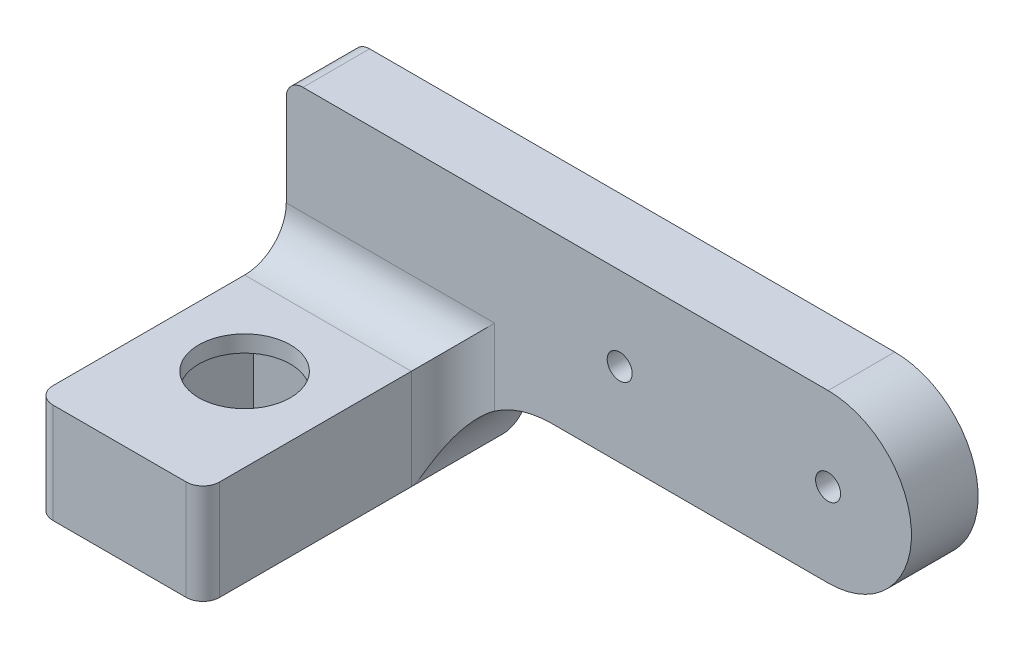
ISO-10303-21;
HEADER;
FILE_DESCRIPTION(('STEP AP214'),'2;1');
FILE_NAME('part.step','',(''),(''),'','','');
FILE_SCHEMA(('AUTOMOTIVE_DESIGN { 1 0 10303 214 1 1 1 1 }'));
ENDSEC;
DATA;
#1=APPLICATION_CONTEXT('core data for automotive mechanical design processes');
#2=APPLICATION_PROTOCOL_DEFINITION('international standard','automotive_design',2000,#1);
#3=PRODUCT_CONTEXT('',#1,'mechanical');
#4=PRODUCT('Part','Part','',(#3));
#5=PRODUCT_RELATED_PRODUCT_CATEGORY('part','',(#4));
#6=PRODUCT_DEFINITION_FORMATION('','',#4);
#7=PRODUCT_DEFINITION_CONTEXT('part definition',#1,'design');
#8=PRODUCT_DEFINITION('design','',#6,#7);
#9=PRODUCT_DEFINITION_SHAPE('','',#8);
#10=(LENGTH_UNIT() NAMED_UNIT(*) SI_UNIT(.MILLI.,.METRE.));
#11=(NAMED_UNIT(*) PLANE_ANGLE_UNIT() SI_UNIT($,.RADIAN.));
#12=(NAMED_UNIT(*) SI_UNIT($,.STERADIAN.) SOLID_ANGLE_UNIT());
#13=UNCERTAINTY_MEASURE_WITH_UNIT(LENGTH_MEASURE(1.E-05),#10,'distance_accuracy_value','');
#14=(GEOMETRIC_REPRESENTATION_CONTEXT(3) GLOBAL_UNCERTAINTY_ASSIGNED_CONTEXT((#13)) GLOBAL_UNIT_ASSIGNED_CONTEXT((#10,
#11,#12)) REPRESENTATION_CONTEXT('',''));
#15=CARTESIAN_POINT('',(0.,0.,0.));
#16=DIRECTION('',(0.,0.,1.));
#17=DIRECTION('',(1.,0.,0.));
#18=AXIS2_PLACEMENT_3D('',#15,#16,#17);
#19=CARTESIAN_POINT('',(40.,0.,0.));
#20=DIRECTION('',(0.,0.,-1.));
#21=DIRECTION('',(1.,0.,0.));
#22=AXIS2_PLACEMENT_3D('',#19,#20,#21);
#23=PLANE('',#22);
#24=CARTESIAN_POINT('',(40.,0.,0.));
#25=DIRECTION('',(0.,0.,1.));
#26=DIRECTION('',(1.,0.,0.));
#27=AXIS2_PLACEMENT_3D('',#24,#25,#26);
#28=CIRCLE('',#27,1.5);
#29=CARTESIAN_POINT('',(41.5,0.,0.));
#30=VERTEX_POINT('',#29);
#31=EDGE_CURVE('E256',#30,#30,#28,.T.);
#32=ORIENTED_EDGE('',*,*,#31,.F.);
#33=EDGE_LOOP('',(#32));
#34=FACE_BOUND('',#33,.T.);
#35=CARTESIAN_POINT('',(15.,0.,0.));
#36=DIRECTION('',(0.,0.,-1.));
#37=DIRECTION('',(-1.,0.,0.));
#38=AXIS2_PLACEMENT_3D('',#35,#36,#37);
#39=CIRCLE('',#38,1.5);
#40=CARTESIAN_POINT('',(13.5,0.,0.));
#41=VERTEX_POINT('',#40);
#42=EDGE_CURVE('E244',#41,#41,#39,.T.);
#43=ORIENTED_EDGE('',*,*,#42,.T.);
#44=EDGE_LOOP('',(#43));
#45=FACE_BOUND('',#44,.T.);
#46=DIRECTION('',(0.,-1.,0.));
#47=VECTOR('',#46,1.);
#48=CARTESIAN_POINT('',(-25.,10.,0.));
#49=LINE('',#48,#47);
#50=CARTESIAN_POINT('',(-25.,8.,0.));
#51=VERTEX_POINT('',#50);
#52=CARTESIAN_POINT('',(-25.,-3.,0.));
#53=VERTEX_POINT('',#52);
#54=EDGE_CURVE('E271',#51,#53,#49,.T.);
#55=ORIENTED_EDGE('',*,*,#54,.T.);
#56=DIRECTION('',(1.,0.,0.));
#57=VECTOR('',#56,1.);
#58=CARTESIAN_POINT('',(-25.,-3.,0.));
#59=LINE('',#58,#57);
#60=CARTESIAN_POINT('',(0.,-3.,0.));
#61=VERTEX_POINT('',#60);
#62=EDGE_CURVE('E299',#61,#53,#59,.F.);
#63=ORIENTED_EDGE('',*,*,#62,.F.);
#64=DIRECTION('',(0.,-1.,0.));
#65=VECTOR('',#64,1.);
#66=CARTESIAN_POINT('',(0.,0.,0.));
#67=LINE('',#66,#65);
#68=CARTESIAN_POINT('',(0.,-12.1348291620473,0.));
#69=VERTEX_POINT('',#68);
#70=EDGE_CURVE('E302',#69,#61,#67,.F.);
#71=ORIENTED_EDGE('',*,*,#70,.F.);
#72=CARTESIAN_POINT('',(6.83215956619924,-22.,0.));
#73=DIRECTION('',(0.,0.,1.));
#74=DIRECTION('',(1.,0.,0.));
#75=AXIS2_PLACEMENT_3D('',#72,#73,#74);
#76=CIRCLE('',#75,12.);
#77=CARTESIAN_POINT('',(6.83215956619923,-10.,0.));
#78=VERTEX_POINT('',#77);
#79=EDGE_CURVE('E289',#78,#69,#76,.T.);
#80=ORIENTED_EDGE('',*,*,#79,.F.);
#81=DIRECTION('',(1.,0.,0.));
#82=VECTOR('',#81,1.);
#83=CARTESIAN_POINT('',(-25.,-10.,0.));
#84=LINE('',#83,#82);
#85=CARTESIAN_POINT('',(40.,-10.,0.));
#86=VERTEX_POINT('',#85);
#87=EDGE_CURVE('E274',#78,#86,#84,.T.);
#88=ORIENTED_EDGE('',*,*,#87,.T.);
#89=CARTESIAN_POINT('',(40.,0.,0.));
#90=DIRECTION('',(0.,0.,1.));
#91=DIRECTION('',(1.,0.,0.));
#92=AXIS2_PLACEMENT_3D('',#89,#90,#91);
#93=CIRCLE('',#92,10.);
#94=CARTESIAN_POINT('',(40.,10.,0.));
#95=VERTEX_POINT('',#94);
#96=EDGE_CURVE('E277',#86,#95,#93,.T.);
#97=ORIENTED_EDGE('',*,*,#96,.T.);
#98=DIRECTION('',(-1.,0.,0.));
#99=VECTOR('',#98,1.);
#100=CARTESIAN_POINT('',(-25.,10.,0.));
#101=LINE('',#100,#99);
#102=CARTESIAN_POINT('',(-23.,10.,0.));
#103=VERTEX_POINT('',#102);
#104=EDGE_CURVE('E261',#95,#103,#101,.T.);
#105=ORIENTED_EDGE('',*,*,#104,.T.);
#106=CARTESIAN_POINT('',(-23.,8.,0.));
#107=DIRECTION('',(0.,0.,1.));
#108=DIRECTION('',(1.,0.,0.));
#109=AXIS2_PLACEMENT_3D('',#106,#107,#108);
#110=CIRCLE('',#109,2.);
#111=EDGE_CURVE('E340',#51,#103,#110,.F.);
#112=ORIENTED_EDGE('',*,*,#111,.F.);
#113=EDGE_LOOP('',(#55,#63,#71,#80,#88,#97,#105,#112));
#114=FACE_BOUND('',#113,.T.);
#115=ADVANCED_FACE('F35',(#34,#45,#114),#23,.F.);
#116=CARTESIAN_POINT('',(-25.,10.,-8.));
#117=DIRECTION('',(1.,0.,0.));
#118=DIRECTION('',(0.,1.,0.));
#119=AXIS2_PLACEMENT_3D('',#116,#117,#118);
#120=PLANE('',#119);
#121=DIRECTION('',(0.,0.,1.));
#122=VECTOR('',#121,1.);
#123=CARTESIAN_POINT('',(-25.,-20.,-8.));
#124=LINE('',#123,#122);
#125=CARTESIAN_POINT('',(-25.,-20.,-6.));
#126=VERTEX_POINT('',#125);
#127=CARTESIAN_POINT('',(-25.,-20.,28.));
#128=VERTEX_POINT('',#127);
#129=EDGE_CURVE('E241',#126,#128,#124,.T.);
#130=ORIENTED_EDGE('',*,*,#129,.T.);
#131=DIRECTION('',(0.,1.,0.));
#132=VECTOR('',#131,1.);
#133=CARTESIAN_POINT('',(-25.,10.,28.));
#134=LINE('',#133,#132);
#135=CARTESIAN_POINT('',(-25.,-8.,28.));
#136=VERTEX_POINT('',#135);
#137=EDGE_CURVE('E411',#136,#128,#134,.F.);
#138=ORIENTED_EDGE('',*,*,#137,.F.);
#139=DIRECTION('',(0.,0.,-1.));
#140=VECTOR('',#139,1.);
#141=CARTESIAN_POINT('',(-25.,-8.,30.));
#142=LINE('',#141,#140);
#143=CARTESIAN_POINT('',(-25.,-8.,5.));
#144=VERTEX_POINT('',#143);
#145=EDGE_CURVE('E234',#136,#144,#142,.T.);
#146=ORIENTED_EDGE('',*,*,#145,.T.);
#147=CARTESIAN_POINT('',(-25.,-3.,5.));
#148=DIRECTION('',(-1.,0.,0.));
#149=DIRECTION('',(0.,1.,0.));
#150=AXIS2_PLACEMENT_3D('',#147,#148,#149);
#151=CIRCLE('',#150,5.);
#152=EDGE_CURVE('E316',#53,#144,#151,.T.);
#153=ORIENTED_EDGE('',*,*,#152,.F.);
#154=ORIENTED_EDGE('',*,*,#54,.F.);
#155=DIRECTION('',(0.,0.,1.));
#156=VECTOR('',#155,1.);
#157=CARTESIAN_POINT('',(-25.,8.,-8.));
#158=LINE('',#157,#156);
#159=CARTESIAN_POINT('',(-25.,8.,-8.));
#160=VERTEX_POINT('',#159);
#161=EDGE_CURVE('E407',#160,#51,#158,.T.);
#162=ORIENTED_EDGE('',*,*,#161,.F.);
#163=DIRECTION('',(0.,-1.,0.));
#164=VECTOR('',#163,1.);
#165=CARTESIAN_POINT('',(-25.,10.,-8.));
#166=LINE('',#165,#164);
#167=CARTESIAN_POINT('',(-25.,-18.,-8.));
#168=VERTEX_POINT('',#167);
#169=EDGE_CURVE('E257',#160,#168,#166,.T.);
#170=ORIENTED_EDGE('',*,*,#169,.T.);
#171=CARTESIAN_POINT('',(-25.,-18.,-6.));
#172=DIRECTION('',(-1.,0.,0.));
#173=DIRECTION('',(0.,1.,0.));
#174=AXIS2_PLACEMENT_3D('',#171,#172,#173);
#175=CIRCLE('',#174,2.);
#176=EDGE_CURVE('E404',#126,#168,#175,.F.);
#177=ORIENTED_EDGE('',*,*,#176,.F.);
#178=EDGE_LOOP('',(#130,#138,#146,#153,#154,#162,#170,#177));
#179=FACE_BOUND('',#178,.T.);
#180=ADVANCED_FACE('F328',(#179),#120,.F.);
#181=CARTESIAN_POINT('',(-25.,-10.,-8.));
#182=DIRECTION('',(0.,1.,0.));
#183=DIRECTION('',(0.,0.,-1.));
#184=AXIS2_PLACEMENT_3D('',#181,#182,#183);
#185=PLANE('',#184);
#186=DIRECTION('',(1.,0.,0.));
#187=VECTOR('',#186,1.);
#188=CARTESIAN_POINT('',(-25.,-10.,-8.));
#189=LINE('',#188,#187);
#190=CARTESIAN_POINT('',(6.83215956619923,-10.,-8.));
#191=VERTEX_POINT('',#190);
#192=CARTESIAN_POINT('',(40.,-10.,-8.));
#193=VERTEX_POINT('',#192);
#194=EDGE_CURVE('E260',#191,#193,#189,.T.);
#195=ORIENTED_EDGE('',*,*,#194,.T.);
#196=DIRECTION('',(0.,0.,1.));
#197=VECTOR('',#196,1.);
#198=CARTESIAN_POINT('',(40.,-10.,-8.));
#199=LINE('',#198,#197);
#200=EDGE_CURVE('E283',#193,#86,#199,.T.);
#201=ORIENTED_EDGE('',*,*,#200,.T.);
#202=ORIENTED_EDGE('',*,*,#87,.F.);
#203=DIRECTION('',(0.,0.,1.));
#204=VECTOR('',#203,1.);
#205=CARTESIAN_POINT('',(6.83215956619923,-10.,-8.));
#206=LINE('',#205,#204);
#207=EDGE_CURVE('E285',#191,#78,#206,.T.);
#208=ORIENTED_EDGE('',*,*,#207,.F.);
#209=EDGE_LOOP('',(#195,#201,#202,#208));
#210=FACE_BOUND('',#209,.T.);
#211=ADVANCED_FACE('F366',(#210),#185,.F.);
#212=CARTESIAN_POINT('',(40.,0.,-8.));
#213=DIRECTION('',(0.,0.,1.));
#214=DIRECTION('',(-1.,0.,0.));
#215=AXIS2_PLACEMENT_3D('',#212,#213,#214);
#216=CYLINDRICAL_SURFACE('',#215,10.);
#217=ORIENTED_EDGE('',*,*,#96,.F.);
#218=ORIENTED_EDGE('',*,*,#200,.F.);
#219=CARTESIAN_POINT('',(40.,0.,-8.));
#220=DIRECTION('',(0.,0.,1.));
#221=DIRECTION('',(1.,0.,0.));
#222=AXIS2_PLACEMENT_3D('',#219,#220,#221);
#223=CIRCLE('',#222,10.);
#224=CARTESIAN_POINT('',(40.,10.,-8.));
#225=VERTEX_POINT('',#224);
#226=EDGE_CURVE('E264',#193,#225,#223,.T.);
#227=ORIENTED_EDGE('',*,*,#226,.T.);
#228=DIRECTION('',(0.,0.,1.));
#229=VECTOR('',#228,1.);
#230=CARTESIAN_POINT('',(40.,10.,-8.));
#231=LINE('',#230,#229);
#232=EDGE_CURVE('E270',#225,#95,#231,.T.);
#233=ORIENTED_EDGE('',*,*,#232,.T.);
#234=EDGE_LOOP('',(#217,#218,#227,#233));
#235=FACE_BOUND('',#234,.T.);
#236=ADVANCED_FACE('F377',(#235),#216,.T.);
#237=CARTESIAN_POINT('',(-25.,10.,-8.));
#238=DIRECTION('',(0.,-1.,0.));
#239=DIRECTION('',(0.,0.,1.));
#240=AXIS2_PLACEMENT_3D('',#237,#238,#239);
#241=PLANE('',#240);
#242=ORIENTED_EDGE('',*,*,#104,.F.);
#243=ORIENTED_EDGE('',*,*,#232,.F.);
#244=DIRECTION('',(-1.,0.,0.));
#245=VECTOR('',#244,1.);
#246=CARTESIAN_POINT('',(-25.,10.,-8.));
#247=LINE('',#246,#245);
#248=CARTESIAN_POINT('',(-23.,10.,-8.));
#249=VERTEX_POINT('',#248);
#250=EDGE_CURVE('E267',#225,#249,#247,.T.);
#251=ORIENTED_EDGE('',*,*,#250,.T.);
#252=DIRECTION('',(0.,0.,1.));
#253=VECTOR('',#252,1.);
#254=CARTESIAN_POINT('',(-23.,10.,-8.));
#255=LINE('',#254,#253);
#256=EDGE_CURVE('E451',#103,#249,#255,.F.);
#257=ORIENTED_EDGE('',*,*,#256,.F.);
#258=EDGE_LOOP('',(#242,#243,#251,#257));
#259=FACE_BOUND('',#258,.T.);
#260=ADVANCED_FACE('F374',(#259),#241,.F.);
#261=CARTESIAN_POINT('',(40.,0.,-8.));
#262=DIRECTION('',(0.,0.,-1.));
#263=DIRECTION('',(1.,0.,0.));
#264=AXIS2_PLACEMENT_3D('',#261,#262,#263);
#265=PLANE('',#264);
#266=CARTESIAN_POINT('',(15.,0.,-8.));
#267=DIRECTION('',(0.,0.,1.));
#268=DIRECTION('',(1.,0.,0.));
#269=AXIS2_PLACEMENT_3D('',#266,#267,#268);
#270=CIRCLE('',#269,1.5);
#271=CARTESIAN_POINT('',(16.5,0.,-8.));
#272=VERTEX_POINT('',#271);
#273=EDGE_CURVE('E250',#272,#272,#270,.T.);
#274=ORIENTED_EDGE('',*,*,#273,.T.);
#275=EDGE_LOOP('',(#274));
#276=FACE_BOUND('',#275,.T.);
#277=CARTESIAN_POINT('',(40.,0.,-8.));
#278=DIRECTION('',(0.,0.,1.));
#279=DIRECTION('',(1.,0.,0.));
#280=AXIS2_PLACEMENT_3D('',#277,#278,#279);
#281=CIRCLE('',#280,1.5);
#282=CARTESIAN_POINT('',(41.5,0.,-8.));
#283=VERTEX_POINT('',#282);
#284=EDGE_CURVE('E253',#283,#283,#281,.T.);
#285=ORIENTED_EDGE('',*,*,#284,.T.);
#286=EDGE_LOOP('',(#285));
#287=FACE_BOUND('',#286,.T.);
#288=ORIENTED_EDGE('',*,*,#169,.F.);
#289=CARTESIAN_POINT('',(-23.,8.,-8.));
#290=DIRECTION('',(0.,0.,1.));
#291=DIRECTION('',(1.,0.,0.));
#292=AXIS2_PLACEMENT_3D('',#289,#290,#291);
#293=CIRCLE('',#292,2.);
#294=EDGE_CURVE('E405',#249,#160,#293,.T.);
#295=ORIENTED_EDGE('',*,*,#294,.F.);
#296=ORIENTED_EDGE('',*,*,#250,.F.);
#297=ORIENTED_EDGE('',*,*,#226,.F.);
#298=ORIENTED_EDGE('',*,*,#194,.F.);
#299=CARTESIAN_POINT('',(6.83215956619924,-22.,-8.));
#300=DIRECTION('',(0.,0.,1.));
#301=DIRECTION('',(1.,0.,0.));
#302=AXIS2_PLACEMENT_3D('',#299,#300,#301);
#303=CIRCLE('',#302,12.);
#304=CARTESIAN_POINT('',(-4.48154893278553,-18.,-8.));
#305=VERTEX_POINT('',#304);
#306=EDGE_CURVE('E292',#305,#191,#303,.F.);
#307=ORIENTED_EDGE('',*,*,#306,.F.);
#308=DIRECTION('',(-1.,0.,0.));
#309=VECTOR('',#308,1.);
#310=CARTESIAN_POINT('',(40.,-18.,-8.));
#311=LINE('',#310,#309);
#312=EDGE_CURVE('E341',#168,#305,#311,.F.);
#313=ORIENTED_EDGE('',*,*,#312,.F.);
#314=EDGE_LOOP('',(#288,#295,#296,#297,#298,#307,#313));
#315=FACE_BOUND('',#314,.T.);
#316=ADVANCED_FACE('F372',(#276,#287,#315),#265,.T.);
#317=CARTESIAN_POINT('',(40.,0.,2.));
#318=DIRECTION('',(0.,0.,-1.));
#319=DIRECTION('',(1.,0.,0.));
#320=AXIS2_PLACEMENT_3D('',#317,#318,#319);
#321=CYLINDRICAL_SURFACE('',#320,1.5);
#322=ORIENTED_EDGE('',*,*,#284,.F.);
#323=EDGE_LOOP('',(#322));
#324=FACE_BOUND('',#323,.T.);
#325=ORIENTED_EDGE('',*,*,#31,.T.);
#326=EDGE_LOOP('',(#325));
#327=FACE_BOUND('',#326,.T.);
#328=ADVANCED_FACE('F474',(#324,#327),#321,.F.);
#329=CARTESIAN_POINT('',(15.,0.,-10.));
#330=DIRECTION('',(0.,0.,1.));
#331=DIRECTION('',(-1.,0.,0.));
#332=AXIS2_PLACEMENT_3D('',#329,#330,#331);
#333=CYLINDRICAL_SURFACE('',#332,1.5);
#334=ORIENTED_EDGE('',*,*,#273,.F.);
#335=EDGE_LOOP('',(#334));
#336=FACE_BOUND('',#335,.T.);
#337=ORIENTED_EDGE('',*,*,#42,.F.);
#338=EDGE_LOOP('',(#337));
#339=FACE_BOUND('',#338,.T.);
#340=ADVANCED_FACE('F470',(#336,#339),#333,.F.);
#341=CARTESIAN_POINT('',(-25.,-20.,-8.));
#342=DIRECTION('',(0.,-1.,0.));
#343=DIRECTION('',(1.,0.,0.));
#344=AXIS2_PLACEMENT_3D('',#341,#342,#343);
#345=PLANE('',#344);
#346=DIRECTION('',(-0.642787609686542,0.,-0.766044443118976));
#347=VECTOR('',#346,1.);
#348=CARTESIAN_POINT('',(-6.62913409939624,-20.,13.5239904898311));
#349=LINE('',#348,#347);
#350=CARTESIAN_POINT('',(-6.62913409939624,-20.,13.5239904898311));
#351=VERTEX_POINT('',#350);
#352=CARTESIAN_POINT('',(-12.0928287817318,-20.,7.01261272331977));
#353=VERTEX_POINT('',#352);
#354=EDGE_CURVE('E208',#351,#353,#349,.T.);
#355=ORIENTED_EDGE('',*,*,#354,.T.);
#356=DIRECTION('',(-0.984807753012207,0.,0.173648177666934));
#357=VECTOR('',#356,1.);
#358=CARTESIAN_POINT('',(-12.0928287817318,-20.,7.01261272331977));
#359=LINE('',#358,#357);
#360=CARTESIAN_POINT('',(-20.4636946823356,-20.,8.4886222334887));
#361=VERTEX_POINT('',#360);
#362=EDGE_CURVE('E185',#353,#361,#359,.T.);
#363=ORIENTED_EDGE('',*,*,#362,.T.);
#364=DIRECTION('',(-0.342020143325665,0.,0.939692620785909));
#365=VECTOR('',#364,1.);
#366=CARTESIAN_POINT('',(-20.4636946823356,-20.,8.4886222334887));
#367=LINE('',#366,#365);
#368=CARTESIAN_POINT('',(-23.3708659006038,-20.,16.4760095101689));
#369=VERTEX_POINT('',#368);
#370=EDGE_CURVE('E212',#361,#369,#367,.T.);
#371=ORIENTED_EDGE('',*,*,#370,.T.);
#372=DIRECTION('',(0.642787609686542,0.,0.766044443118976));
#373=VECTOR('',#372,1.);
#374=CARTESIAN_POINT('',(-23.3708659006038,-20.,16.4760095101689));
#375=LINE('',#374,#373);
#376=CARTESIAN_POINT('',(-17.9071712182682,-20.,22.9873872766802));
#377=VERTEX_POINT('',#376);
#378=EDGE_CURVE('E215',#369,#377,#375,.T.);
#379=ORIENTED_EDGE('',*,*,#378,.T.);
#380=DIRECTION('',(0.984807753012208,0.,-0.173648177666933));
#381=VECTOR('',#380,1.);
#382=CARTESIAN_POINT('',(-17.9071712182682,-20.,22.9873872766802));
#383=LINE('',#382,#381);
#384=CARTESIAN_POINT('',(-9.5363053176644,-20.,21.5113777665113));
#385=VERTEX_POINT('',#384);
#386=EDGE_CURVE('E197',#377,#385,#383,.T.);
#387=ORIENTED_EDGE('',*,*,#386,.T.);
#388=DIRECTION('',(0.342020143325665,0.,-0.93969262078591));
#389=VECTOR('',#388,1.);
#390=CARTESIAN_POINT('',(-9.5363053176644,-20.,21.5113777665113));
#391=LINE('',#390,#389);
#392=EDGE_CURVE('E194',#385,#351,#391,.T.);
#393=ORIENTED_EDGE('',*,*,#392,.T.);
#394=EDGE_LOOP('',(#355,#363,#371,#379,#387,#393));
#395=FACE_BOUND('',#394,.T.);
#396=DIRECTION('',(0.,0.,1.));
#397=VECTOR('',#396,1.);
#398=CARTESIAN_POINT('',(-5.,-20.,-8.));
#399=LINE('',#398,#397);
#400=CARTESIAN_POINT('',(-5.,-20.,-6.));
#401=VERTEX_POINT('',#400);
#402=CARTESIAN_POINT('',(-5.,-20.,5.));
#403=VERTEX_POINT('',#402);
#404=EDGE_CURVE('E245',#401,#403,#399,.T.);
#405=ORIENTED_EDGE('',*,*,#404,.T.);
#406=CARTESIAN_POINT('',(-5.,-20.,28.));
#407=VERTEX_POINT('',#406);
#408=EDGE_CURVE('E240',#403,#407,#399,.T.);
#409=ORIENTED_EDGE('',*,*,#408,.T.);
#410=CARTESIAN_POINT('',(-7.,-20.,28.));
#411=DIRECTION('',(0.,1.,0.));
#412=DIRECTION('',(1.,0.,0.));
#413=AXIS2_PLACEMENT_3D('',#410,#411,#412);
#414=CIRCLE('',#413,2.);
#415=CARTESIAN_POINT('',(-7.,-20.,30.));
#416=VERTEX_POINT('',#415);
#417=EDGE_CURVE('E416',#416,#407,#414,.T.);
#418=ORIENTED_EDGE('',*,*,#417,.F.);
#419=DIRECTION('',(-1.,0.,0.));
#420=VECTOR('',#419,1.);
#421=CARTESIAN_POINT('',(-25.,-20.,30.));
#422=LINE('',#421,#420);
#423=CARTESIAN_POINT('',(-23.,-20.,30.));
#424=VERTEX_POINT('',#423);
#425=EDGE_CURVE('E237',#416,#424,#422,.T.);
#426=ORIENTED_EDGE('',*,*,#425,.T.);
#427=CARTESIAN_POINT('',(-23.,-20.,28.));
#428=DIRECTION('',(0.,1.,0.));
#429=DIRECTION('',(1.,0.,0.));
#430=AXIS2_PLACEMENT_3D('',#427,#428,#429);
#431=CIRCLE('',#430,2.);
#432=EDGE_CURVE('E419',#128,#424,#431,.T.);
#433=ORIENTED_EDGE('',*,*,#432,.F.);
#434=ORIENTED_EDGE('',*,*,#129,.F.);
#435=DIRECTION('',(-1.,0.,0.));
#436=VECTOR('',#435,1.);
#437=CARTESIAN_POINT('',(-25.,-20.,-6.));
#438=LINE('',#437,#436);
#439=EDGE_CURVE('E414',#401,#126,#438,.T.);
#440=ORIENTED_EDGE('',*,*,#439,.F.);
#441=EDGE_LOOP('',(#405,#409,#418,#426,#433,#434,#440));
#442=FACE_BOUND('',#441,.T.);
#443=ADVANCED_FACE('F456',(#395,#442),#345,.T.);
#444=CARTESIAN_POINT('',(-5.,-10.,-8.));
#445=DIRECTION('',(1.,0.,0.));
#446=DIRECTION('',(0.,0.,1.));
#447=AXIS2_PLACEMENT_3D('',#444,#445,#446);
#448=PLANE('',#447);
#449=ORIENTED_EDGE('',*,*,#408,.F.);
#450=DIRECTION('',(0.,-1.,0.));
#451=VECTOR('',#450,1.);
#452=CARTESIAN_POINT('',(-5.,-10.,5.));
#453=LINE('',#452,#451);
#454=CARTESIAN_POINT('',(-5.,-8.,5.));
#455=VERTEX_POINT('',#454);
#456=EDGE_CURVE('E294',#455,#403,#453,.T.);
#457=ORIENTED_EDGE('',*,*,#456,.F.);
#458=DIRECTION('',(0.,0.,1.));
#459=VECTOR('',#458,1.);
#460=CARTESIAN_POINT('',(-5.,-8.,30.));
#461=LINE('',#460,#459);
#462=CARTESIAN_POINT('',(-5.,-8.,28.));
#463=VERTEX_POINT('',#462);
#464=EDGE_CURVE('E221',#455,#463,#461,.T.);
#465=ORIENTED_EDGE('',*,*,#464,.T.);
#466=DIRECTION('',(0.,-1.,0.));
#467=VECTOR('',#466,1.);
#468=CARTESIAN_POINT('',(-5.,-8.,28.));
#469=LINE('',#468,#467);
#470=EDGE_CURVE('E446',#407,#463,#469,.F.);
#471=ORIENTED_EDGE('',*,*,#470,.F.);
#472=EDGE_LOOP('',(#449,#457,#465,#471));
#473=FACE_BOUND('',#472,.T.);
#474=ADVANCED_FACE('F439',(#473),#448,.T.);
#475=CARTESIAN_POINT('',(0.,0.,30.));
#476=DIRECTION('',(0.,0.,-1.));
#477=DIRECTION('',(1.,0.,0.));
#478=AXIS2_PLACEMENT_3D('',#475,#476,#477);
#479=PLANE('',#478);
#480=DIRECTION('',(-1.,0.,0.));
#481=VECTOR('',#480,1.);
#482=CARTESIAN_POINT('',(-5.,-8.,30.));
#483=LINE('',#482,#481);
#484=CARTESIAN_POINT('',(-7.,-8.,30.));
#485=VERTEX_POINT('',#484);
#486=CARTESIAN_POINT('',(-23.,-8.,30.));
#487=VERTEX_POINT('',#486);
#488=EDGE_CURVE('E231',#485,#487,#483,.T.);
#489=ORIENTED_EDGE('',*,*,#488,.T.);
#490=DIRECTION('',(0.,1.,0.));
#491=VECTOR('',#490,1.);
#492=CARTESIAN_POINT('',(-23.,0.,30.));
#493=LINE('',#492,#491);
#494=EDGE_CURVE('E445',#424,#487,#493,.T.);
#495=ORIENTED_EDGE('',*,*,#494,.F.);
#496=ORIENTED_EDGE('',*,*,#425,.F.);
#497=DIRECTION('',(0.,-1.,0.));
#498=VECTOR('',#497,1.);
#499=CARTESIAN_POINT('',(-7.,-20.,30.));
#500=LINE('',#499,#498);
#501=EDGE_CURVE('E447',#485,#416,#500,.T.);
#502=ORIENTED_EDGE('',*,*,#501,.F.);
#503=EDGE_LOOP('',(#489,#495,#496,#502));
#504=FACE_BOUND('',#503,.T.);
#505=ADVANCED_FACE('F326',(#504),#479,.F.);
#506=CARTESIAN_POINT('',(6.83215956619924,-22.,-8.));
#507=DIRECTION('',(0.,0.,1.));
#508=DIRECTION('',(-1.,0.,0.));
#509=AXIS2_PLACEMENT_3D('',#506,#507,#508);
#510=CYLINDRICAL_SURFACE('',#509,12.);
#511=ORIENTED_EDGE('',*,*,#306,.T.);
#512=ORIENTED_EDGE('',*,*,#207,.T.);
#513=ORIENTED_EDGE('',*,*,#79,.T.);
#514=CARTESIAN_POINT('',(-5.,-20.,5.));
#515=CARTESIAN_POINT('',(-5.00002983071516,-20.0002423652182,4.94276954902935));
#516=CARTESIAN_POINT('',(-4.99901934267985,-19.9941907321539,4.88595530761524));
#517=CARTESIAN_POINT('',(-4.99525039157633,-19.9720554020881,4.77555185338585));
#518=CARTESIAN_POINT('',(-4.99252898286227,-19.9561844798837,4.72192001648874));
#519=CARTESIAN_POINT('',(-4.98408791010207,-19.90785267169,4.59418000961095));
#520=CARTESIAN_POINT('',(-4.97756841164664,-19.8711330466681,4.52180614517529));
#521=CARTESIAN_POINT('',(-4.96223202410665,-19.7877219107002,4.3825808930968));
#522=CARTESIAN_POINT('',(-4.95339017335325,-19.7409231136344,4.31580059752893));
#523=CARTESIAN_POINT('',(-4.92774697062384,-19.6101574112571,4.14638742167474));
#524=CARTESIAN_POINT('',(-4.90944657037671,-19.5213908358724,4.04776496875074));
#525=CARTESIAN_POINT('',(-4.86890013634191,-19.336487127318,3.85845009250445));
#526=CARTESIAN_POINT('',(-4.8466436889024,-19.2403309309494,3.76777956580897));
#527=CARTESIAN_POINT('',(-4.79843003565541,-19.0437085450451,3.59166124125073));
#528=CARTESIAN_POINT('',(-4.7724617061297,-18.9432300591574,3.50623028658098));
#529=CARTESIAN_POINT('',(-4.71703917712112,-18.7400762924599,3.33950703775577));
#530=CARTESIAN_POINT('',(-4.68758913168601,-18.6374037469055,3.2582099738707));
#531=CARTESIAN_POINT('',(-4.61901325405676,-18.4100985902356,3.08290445499588));
#532=CARTESIAN_POINT('',(-4.57912825037921,-18.2851624051574,2.98958644310515));
#533=CARTESIAN_POINT('',(-4.49437716998494,-18.034255935153,2.80666530000505));
#534=CARTESIAN_POINT('',(-4.44951033121737,-17.9082854947577,2.71706274002012));
#535=CARTESIAN_POINT('',(-4.30730488015702,-17.5295368759611,2.4530012696897));
#536=CARTESIAN_POINT('',(-4.2024203561827,-17.2761195498434,2.28343795798222));
#537=CARTESIAN_POINT('',(-3.9722913836724,-16.7711556777164,1.95686688191674));
#538=CARTESIAN_POINT('',(-3.84708080936692,-16.5196067351079,1.79983886555038));
#539=CARTESIAN_POINT('',(-3.57558827900187,-16.0200735556958,1.49911766184629));
#540=CARTESIAN_POINT('',(-3.4293185993765,-15.7720873339923,1.35541678512763));
#541=CARTESIAN_POINT('',(-3.14961065204293,-15.335473435628,1.11332897815827));
#542=CARTESIAN_POINT('',(-3.0204258322933,-15.1457864250495,1.01192702679406));
#543=CARTESIAN_POINT('',(-2.7485294155333,-14.7706115192609,0.819893533912961));
#544=CARTESIAN_POINT('',(-2.60581660491877,-14.5851240026428,0.729262960349702));
#545=CARTESIAN_POINT('',(-2.30728539567637,-14.2201589955088,0.560890363369335));
#546=CARTESIAN_POINT('',(-2.15151761366808,-14.0406617508639,0.483101744511609));
#547=CARTESIAN_POINT('',(-1.82648848948985,-13.6882485401282,0.342179324884258));
#548=CARTESIAN_POINT('',(-1.65723183331395,-13.5153303190805,0.279040464390576));
#549=CARTESIAN_POINT('',(-1.36841508496078,-13.2378560430232,0.189444479936658));
#550=CARTESIAN_POINT('',(-1.25267734182957,-13.1309270879083,0.157938067629622));
#551=CARTESIAN_POINT('',(-1.01604778268768,-12.9208668537399,0.102817284378438));
#552=CARTESIAN_POINT('',(-0.895157979504437,-12.8177341203861,0.0791998626316512));
#553=CARTESIAN_POINT('',(-0.647824429568627,-12.6151449323776,0.0405569345325324));
#554=CARTESIAN_POINT('',(-0.521353323286093,-12.5157123550073,0.0255803859630951));
#555=CARTESIAN_POINT('',(-0.263900565394985,-12.32156759435,0.00529847183239202));
#556=CARTESIAN_POINT('',(-0.132914578924757,-12.2268601740619,2.6803381606355E-06));
#557=CARTESIAN_POINT('',(0.,-12.1348291620473,0.));
#558=B_SPLINE_CURVE_WITH_KNOTS('',3,(#514,#515,#516,#517,#518,#519,#520,#521,#522,#523,#524,
#525,#526,#527,#528,#529,#530,#531,#532,#533,#534,#535,#536,#537,#538,#539,#540,#541,#542,#543,
#544,#545,#546,#547,#548,#549,#550,#551,#552,#553,#554,#555,#556,#557),.UNSPECIFIED.,.F.,.F.,(4,
2,2,2,2,2,2,2,2,2,2,2,2,2,2,2,2,2,2,2,2,4),(0.,0.170703151596656,0.337830952092287,
0.580693490649767,0.826281587637511,1.22705914658555,1.62890774734898,2.03198688396057,
2.43458986869146,2.91732242315391,3.40012892122403,4.3665052326105,5.33128726545324,
6.29550913757507,7.04766010365497,7.79987860962329,8.54930476127781,9.29847169003779,
9.78026574132661,10.2618732586285,10.7461833470875,11.2309721495371),.UNSPECIFIED.);
#559=EDGE_CURVE('E308',#403,#69,#558,.T.);
#560=ORIENTED_EDGE('',*,*,#559,.F.);
#561=ORIENTED_EDGE('',*,*,#404,.F.);
#562=CARTESIAN_POINT('',(-4.48154893278553,-18.,-8.));
#563=CARTESIAN_POINT('',(-4.50138125313948,-18.0560877717623,-7.99999832305192));
#564=CARTESIAN_POINT('',(-4.52078424019849,-18.1123031979097,-7.99763882394037));
#565=CARTESIAN_POINT('',(-4.55864154941412,-18.2246643135857,-7.98814251719226));
#566=CARTESIAN_POINT('',(-4.57709563531679,-18.2808099823833,-7.98100452596653));
#567=CARTESIAN_POINT('',(-4.63089238189496,-18.4486356009318,-7.95232807713334));
#568=CARTESIAN_POINT('',(-4.66466130278686,-18.559680833343,-7.92352709442766));
#569=CARTESIAN_POINT('',(-4.72735408814331,-18.7765785860345,-7.84667328021879));
#570=CARTESIAN_POINT('',(-4.7562683096932,-18.8824204829235,-7.79858276083968));
#571=CARTESIAN_POINT('',(-4.80888524868177,-19.0850345721453,-7.68410594838005));
#572=CARTESIAN_POINT('',(-4.8325930659608,-19.1818155860983,-7.61773770389394));
#573=CARTESIAN_POINT('',(-4.87405212171451,-19.3594265529934,-7.47129257380848));
#574=CARTESIAN_POINT('',(-4.89199696991578,-19.4407259787916,-7.39183921718088));
#575=CARTESIAN_POINT('',(-4.92339777930131,-19.5890591318635,-7.21975075455985));
#576=CARTESIAN_POINT('',(-4.93685253648592,-19.6560890310796,-7.12711212247243));
#577=CARTESIAN_POINT('',(-4.95935046191041,-19.772062493677,-6.93390339662555));
#578=CARTESIAN_POINT('',(-4.96849692689365,-19.8214219011766,-6.83359426728588));
#579=CARTESIAN_POINT('',(-4.98322858152512,-19.902781623108,-6.62596324805298));
#580=CARTESIAN_POINT('',(-4.98881654519301,-19.9347954563216,-6.51864689275829));
#581=CARTESIAN_POINT('',(-4.99519390458775,-19.9717226972868,-6.34212747261345));
#582=CARTESIAN_POINT('',(-4.99700177862493,-19.9823210790566,-6.27409656410973));
#583=CARTESIAN_POINT('',(-4.99940140648305,-19.9964577732676,-6.13738714644132));
#584=CARTESIAN_POINT('',(-4.99999497922922,-20.0000066450736,-6.06870976091195));
#585=CARTESIAN_POINT('',(-5.,-20.,-6.));
#586=B_SPLINE_CURVE_WITH_KNOTS('',3,(#562,#563,#564,#565,#566,#567,#568,#569,#570,#571,#572,
#573,#574,#575,#576,#577,#578,#579,#580,#581,#582,#583,#584,#585),.UNSPECIFIED.,.F.,.F.,(4,2,2,
2,2,2,2,2,2,2,2,4),(0.,0.17837527524822,0.356794748790082,0.713707003854084,1.07132001712111,
1.42858115883977,1.7721376621222,2.11578621480146,2.45071320477386,2.78537878270886,
2.99165964856607,3.19763129543271),.UNSPECIFIED.);
#587=EDGE_CURVE('E332',#305,#401,#586,.T.);
#588=ORIENTED_EDGE('',*,*,#587,.F.);
#589=EDGE_LOOP('',(#511,#512,#513,#560,#561,#588));
#590=FACE_BOUND('',#589,.T.);
#591=ADVANCED_FACE('F321',(#590),#510,.F.);
#592=CARTESIAN_POINT('',(0.,-8.,0.));
#593=DIRECTION('',(0.,-1.,0.));
#594=DIRECTION('',(1.,0.,0.));
#595=AXIS2_PLACEMENT_3D('',#592,#593,#594);
#596=PLANE('',#595);
#597=CARTESIAN_POINT('',(-15.,-8.,15.));
#598=DIRECTION('',(0.,1.,0.));
#599=DIRECTION('',(1.,0.,0.));
#600=AXIS2_PLACEMENT_3D('',#597,#598,#599);
#601=CIRCLE('',#600,5.5);
#602=CARTESIAN_POINT('',(-9.5,-8.,15.));
#603=VERTEX_POINT('',#602);
#604=EDGE_CURVE('E210',#603,#603,#601,.T.);
#605=ORIENTED_EDGE('',*,*,#604,.F.);
#606=EDGE_LOOP('',(#605));
#607=FACE_BOUND('',#606,.T.);
#608=ORIENTED_EDGE('',*,*,#464,.F.);
#609=DIRECTION('',(1.,0.,0.));
#610=VECTOR('',#609,1.);
#611=CARTESIAN_POINT('',(-5.,-8.,5.));
#612=LINE('',#611,#610);
#613=EDGE_CURVE('E305',#144,#455,#612,.T.);
#614=ORIENTED_EDGE('',*,*,#613,.F.);
#615=ORIENTED_EDGE('',*,*,#145,.F.);
#616=CARTESIAN_POINT('',(-23.,-8.,28.));
#617=DIRECTION('',(0.,1.,0.));
#618=DIRECTION('',(1.,0.,0.));
#619=AXIS2_PLACEMENT_3D('',#616,#617,#618);
#620=CIRCLE('',#619,2.);
#621=EDGE_CURVE('E43',#487,#136,#620,.F.);
#622=ORIENTED_EDGE('',*,*,#621,.F.);
#623=ORIENTED_EDGE('',*,*,#488,.F.);
#624=CARTESIAN_POINT('',(-7.,-8.,28.));
#625=DIRECTION('',(0.,1.,0.));
#626=DIRECTION('',(1.,0.,0.));
#627=AXIS2_PLACEMENT_3D('',#624,#625,#626);
#628=CIRCLE('',#627,2.);
#629=EDGE_CURVE('E11',#463,#485,#628,.F.);
#630=ORIENTED_EDGE('',*,*,#629,.F.);
#631=EDGE_LOOP('',(#608,#614,#615,#622,#623,#630));
#632=FACE_BOUND('',#631,.T.);
#633=ADVANCED_FACE('F325',(#607,#632),#596,.F.);
#634=CARTESIAN_POINT('',(-6.62913409939624,-10.,13.5239904898311));
#635=DIRECTION('',(0.766044443118976,0.,-0.642787609686542));
#636=DIRECTION('',(0.642787609686542,0.,0.766044443118976));
#637=AXIS2_PLACEMENT_3D('',#634,#635,#636);
#638=PLANE('',#637);
#639=ORIENTED_EDGE('',*,*,#354,.F.);
#640=DIRECTION('',(0.,-1.,0.));
#641=VECTOR('',#640,1.);
#642=CARTESIAN_POINT('',(-6.62913409939624,-10.,13.5239904898311));
#643=LINE('',#642,#641);
#644=CARTESIAN_POINT('',(-6.62913409939624,-10.,13.5239904898311));
#645=VERTEX_POINT('',#644);
#646=EDGE_CURVE('E193',#645,#351,#643,.T.);
#647=ORIENTED_EDGE('',*,*,#646,.F.);
#648=DIRECTION('',(-0.642787609686542,0.,-0.766044443118976));
#649=VECTOR('',#648,1.);
#650=CARTESIAN_POINT('',(-6.62913409939624,-10.,13.5239904898311));
#651=LINE('',#650,#649);
#652=CARTESIAN_POINT('',(-12.0928287817318,-10.,7.01261272331977));
#653=VERTEX_POINT('',#652);
#654=EDGE_CURVE('E174',#645,#653,#651,.T.);
#655=ORIENTED_EDGE('',*,*,#654,.T.);
#656=DIRECTION('',(0.,-1.,0.));
#657=VECTOR('',#656,1.);
#658=CARTESIAN_POINT('',(-12.0928287817318,-10.,7.01261272331977));
#659=LINE('',#658,#657);
#660=EDGE_CURVE('E182',#653,#353,#659,.T.);
#661=ORIENTED_EDGE('',*,*,#660,.T.);
#662=EDGE_LOOP('',(#639,#647,#655,#661));
#663=FACE_BOUND('',#662,.T.);
#664=ADVANCED_FACE('F192',(#663),#638,.F.);
#665=CARTESIAN_POINT('',(-9.53630531766439,-10.,21.5113777665113));
#666=DIRECTION('',(0.93969262078591,0.,0.342020143325665));
#667=DIRECTION('',(-0.342020143325665,0.,0.93969262078591));
#668=AXIS2_PLACEMENT_3D('',#665,#666,#667);
#669=PLANE('',#668);
#670=ORIENTED_EDGE('',*,*,#392,.F.);
#671=DIRECTION('',(0.,-1.,0.));
#672=VECTOR('',#671,1.);
#673=CARTESIAN_POINT('',(-9.53630531766439,-10.,21.5113777665113));
#674=LINE('',#673,#672);
#675=CARTESIAN_POINT('',(-9.53630531766439,-10.,21.5113777665113));
#676=VERTEX_POINT('',#675);
#677=EDGE_CURVE('E222',#676,#385,#674,.T.);
#678=ORIENTED_EDGE('',*,*,#677,.F.);
#679=DIRECTION('',(0.342020143325665,0.,-0.93969262078591));
#680=VECTOR('',#679,1.);
#681=CARTESIAN_POINT('',(-9.53630531766439,-10.,21.5113777665113));
#682=LINE('',#681,#680);
#683=EDGE_CURVE('E190',#676,#645,#682,.T.);
#684=ORIENTED_EDGE('',*,*,#683,.T.);
#685=ORIENTED_EDGE('',*,*,#646,.T.);
#686=EDGE_LOOP('',(#670,#678,#684,#685));
#687=FACE_BOUND('',#686,.T.);
#688=ADVANCED_FACE('F574',(#687),#669,.F.);
#689=CARTESIAN_POINT('',(-17.9071712182682,-10.,22.9873872766802));
#690=DIRECTION('',(0.173648177666933,0.,0.984807753012208));
#691=DIRECTION('',(-0.984807753012208,0.,0.173648177666933));
#692=AXIS2_PLACEMENT_3D('',#689,#690,#691);
#693=PLANE('',#692);
#694=ORIENTED_EDGE('',*,*,#386,.F.);
#695=DIRECTION('',(0.,-1.,0.));
#696=VECTOR('',#695,1.);
#697=CARTESIAN_POINT('',(-17.9071712182682,-10.,22.9873872766802));
#698=LINE('',#697,#696);
#699=CARTESIAN_POINT('',(-17.9071712182682,-10.,22.9873872766802));
#700=VERTEX_POINT('',#699);
#701=EDGE_CURVE('E224',#700,#377,#698,.T.);
#702=ORIENTED_EDGE('',*,*,#701,.F.);
#703=DIRECTION('',(0.984807753012208,0.,-0.173648177666933));
#704=VECTOR('',#703,1.);
#705=CARTESIAN_POINT('',(-17.9071712182682,-10.,22.9873872766802));
#706=LINE('',#705,#704);
#707=EDGE_CURVE('E205',#700,#676,#706,.T.);
#708=ORIENTED_EDGE('',*,*,#707,.T.);
#709=ORIENTED_EDGE('',*,*,#677,.T.);
#710=EDGE_LOOP('',(#694,#702,#708,#709));
#711=FACE_BOUND('',#710,.T.);
#712=ADVANCED_FACE('F581',(#711),#693,.F.);
#713=CARTESIAN_POINT('',(-23.3708659006038,-10.,16.4760095101689));
#714=DIRECTION('',(-0.766044443118976,0.,0.642787609686542));
#715=DIRECTION('',(-0.642787609686542,0.,-0.766044443118976));
#716=AXIS2_PLACEMENT_3D('',#713,#714,#715);
#717=PLANE('',#716);
#718=ORIENTED_EDGE('',*,*,#378,.F.);
#719=DIRECTION('',(0.,-1.,0.));
#720=VECTOR('',#719,1.);
#721=CARTESIAN_POINT('',(-23.3708659006038,-10.,16.4760095101689));
#722=LINE('',#721,#720);
#723=CARTESIAN_POINT('',(-23.3708659006038,-10.,16.4760095101689));
#724=VERTEX_POINT('',#723);
#725=EDGE_CURVE('E226',#724,#369,#722,.T.);
#726=ORIENTED_EDGE('',*,*,#725,.F.);
#727=DIRECTION('',(0.642787609686542,0.,0.766044443118976));
#728=VECTOR('',#727,1.);
#729=CARTESIAN_POINT('',(-23.3708659006038,-10.,16.4760095101689));
#730=LINE('',#729,#728);
#731=EDGE_CURVE('E203',#724,#700,#730,.T.);
#732=ORIENTED_EDGE('',*,*,#731,.T.);
#733=ORIENTED_EDGE('',*,*,#701,.T.);
#734=EDGE_LOOP('',(#718,#726,#732,#733));
#735=FACE_BOUND('',#734,.T.);
#736=ADVANCED_FACE('F590',(#735),#717,.F.);
#737=CARTESIAN_POINT('',(-20.4636946823356,-10.,8.4886222334887));
#738=DIRECTION('',(-0.93969262078591,0.,-0.342020143325665));
#739=DIRECTION('',(0.342020143325665,0.,-0.93969262078591));
#740=AXIS2_PLACEMENT_3D('',#737,#738,#739);
#741=PLANE('',#740);
#742=ORIENTED_EDGE('',*,*,#370,.F.);
#743=DIRECTION('',(0.,-1.,0.));
#744=VECTOR('',#743,1.);
#745=CARTESIAN_POINT('',(-20.4636946823356,-10.,8.4886222334887));
#746=LINE('',#745,#744);
#747=CARTESIAN_POINT('',(-20.4636946823356,-10.,8.4886222334887));
#748=VERTEX_POINT('',#747);
#749=EDGE_CURVE('E189',#748,#361,#746,.T.);
#750=ORIENTED_EDGE('',*,*,#749,.F.);
#751=DIRECTION('',(-0.342020143325665,0.,0.939692620785909));
#752=VECTOR('',#751,1.);
#753=CARTESIAN_POINT('',(-20.4636946823356,-10.,8.4886222334887));
#754=LINE('',#753,#752);
#755=EDGE_CURVE('E177',#748,#724,#754,.T.);
#756=ORIENTED_EDGE('',*,*,#755,.T.);
#757=ORIENTED_EDGE('',*,*,#725,.T.);
#758=EDGE_LOOP('',(#742,#750,#756,#757));
#759=FACE_BOUND('',#758,.T.);
#760=ADVANCED_FACE('F599',(#759),#741,.F.);
#761=CARTESIAN_POINT('',(-12.0928287817318,-10.,7.01261272331977));
#762=DIRECTION('',(-0.173648177666934,0.,-0.984807753012207));
#763=DIRECTION('',(0.984807753012207,0.,-0.173648177666934));
#764=AXIS2_PLACEMENT_3D('',#761,#762,#763);
#765=PLANE('',#764);
#766=ORIENTED_EDGE('',*,*,#362,.F.);
#767=ORIENTED_EDGE('',*,*,#660,.F.);
#768=DIRECTION('',(-0.984807753012207,0.,0.173648177666934));
#769=VECTOR('',#768,1.);
#770=CARTESIAN_POINT('',(-12.0928287817318,-10.,7.01261272331977));
#771=LINE('',#770,#769);
#772=EDGE_CURVE('E169',#653,#748,#771,.T.);
#773=ORIENTED_EDGE('',*,*,#772,.T.);
#774=ORIENTED_EDGE('',*,*,#749,.T.);
#775=EDGE_LOOP('',(#766,#767,#773,#774));
#776=FACE_BOUND('',#775,.T.);
#777=ADVANCED_FACE('F183',(#776),#765,.F.);
#778=CARTESIAN_POINT('',(0.,-10.,0.));
#779=DIRECTION('',(0.,-1.,0.));
#780=DIRECTION('',(0.,0.,1.));
#781=AXIS2_PLACEMENT_3D('',#778,#779,#780);
#782=PLANE('',#781);
#783=CARTESIAN_POINT('',(-15.,-10.,15.));
#784=DIRECTION('',(0.,1.,0.));
#785=DIRECTION('',(0.,0.,1.));
#786=AXIS2_PLACEMENT_3D('',#783,#784,#785);
#787=CIRCLE('',#786,5.5);
#788=CARTESIAN_POINT('',(-15.,-10.,20.5));
#789=VERTEX_POINT('',#788);
#790=EDGE_CURVE('E200',#789,#789,#787,.T.);
#791=ORIENTED_EDGE('',*,*,#790,.T.);
#792=EDGE_LOOP('',(#791));
#793=FACE_BOUND('',#792,.T.);
#794=ORIENTED_EDGE('',*,*,#654,.F.);
#795=ORIENTED_EDGE('',*,*,#683,.F.);
#796=ORIENTED_EDGE('',*,*,#707,.F.);
#797=ORIENTED_EDGE('',*,*,#731,.F.);
#798=ORIENTED_EDGE('',*,*,#755,.F.);
#799=ORIENTED_EDGE('',*,*,#772,.F.);
#800=EDGE_LOOP('',(#794,#795,#796,#797,#798,#799));
#801=FACE_BOUND('',#800,.T.);
#802=ADVANCED_FACE('F171',(#793,#801),#782,.T.);
#803=CARTESIAN_POINT('',(-15.,0.,15.));
#804=DIRECTION('',(0.,-1.,0.));
#805=DIRECTION('',(0.,0.,1.));
#806=AXIS2_PLACEMENT_3D('',#803,#804,#805);
#807=CYLINDRICAL_SURFACE('',#806,5.5);
#808=ORIENTED_EDGE('',*,*,#790,.F.);
#809=EDGE_LOOP('',(#808));
#810=FACE_BOUND('',#809,.T.);
#811=ORIENTED_EDGE('',*,*,#604,.T.);
#812=EDGE_LOOP('',(#811));
#813=FACE_BOUND('',#812,.T.);
#814=ADVANCED_FACE('F427',(#810,#813),#807,.F.);
#815=CARTESIAN_POINT('',(0.,-3.,5.));
#816=DIRECTION('',(-1.,0.,0.));
#817=DIRECTION('',(0.,-1.,0.));
#818=AXIS2_PLACEMENT_3D('',#815,#816,#817);
#819=CYLINDRICAL_SURFACE('',#818,5.);
#820=ORIENTED_EDGE('',*,*,#152,.T.);
#821=ORIENTED_EDGE('',*,*,#613,.T.);
#822=CARTESIAN_POINT('',(0.,-3.,5.));
#823=DIRECTION('',(0.707106781186547,-0.707106781186547,0.));
#824=DIRECTION('',(-0.707106781186548,-0.707106781186547,0.));
#825=AXIS2_PLACEMENT_3D('',#822,#823,#824);
#826=ELLIPSE('',#825,7.07106781186547,5.);
#827=EDGE_CURVE('E421',#455,#61,#826,.T.);
#828=ORIENTED_EDGE('',*,*,#827,.T.);
#829=ORIENTED_EDGE('',*,*,#62,.T.);
#830=EDGE_LOOP('',(#820,#821,#828,#829));
#831=FACE_BOUND('',#830,.T.);
#832=ADVANCED_FACE('F350',(#831),#819,.F.);
#833=CARTESIAN_POINT('',(0.,-10.,5.));
#834=DIRECTION('',(0.,-1.,0.));
#835=DIRECTION('',(0.,0.,1.));
#836=AXIS2_PLACEMENT_3D('',#833,#834,#835);
#837=CYLINDRICAL_SURFACE('',#836,5.);
#838=ORIENTED_EDGE('',*,*,#827,.F.);
#839=ORIENTED_EDGE('',*,*,#456,.T.);
#840=ORIENTED_EDGE('',*,*,#559,.T.);
#841=ORIENTED_EDGE('',*,*,#70,.T.);
#842=EDGE_LOOP('',(#838,#839,#840,#841));
#843=FACE_BOUND('',#842,.T.);
#844=ADVANCED_FACE('F318',(#843),#837,.F.);
#845=CARTESIAN_POINT('',(-25.,-18.,-6.));
#846=DIRECTION('',(-1.,0.,0.));
#847=DIRECTION('',(0.,-1.,0.));
#848=AXIS2_PLACEMENT_3D('',#845,#846,#847);
#849=CYLINDRICAL_SURFACE('',#848,2.);
#850=ORIENTED_EDGE('',*,*,#587,.T.);
#851=ORIENTED_EDGE('',*,*,#439,.T.);
#852=ORIENTED_EDGE('',*,*,#176,.T.);
#853=ORIENTED_EDGE('',*,*,#312,.T.);
#854=EDGE_LOOP('',(#850,#851,#852,#853));
#855=FACE_BOUND('',#854,.T.);
#856=ADVANCED_FACE('F344',(#855),#849,.T.);
#857=CARTESIAN_POINT('',(-23.,8.,-8.));
#858=DIRECTION('',(0.,0.,1.));
#859=DIRECTION('',(-1.,0.,0.));
#860=AXIS2_PLACEMENT_3D('',#857,#858,#859);
#861=CYLINDRICAL_SURFACE('',#860,2.);
#862=ORIENTED_EDGE('',*,*,#294,.T.);
#863=ORIENTED_EDGE('',*,*,#161,.T.);
#864=ORIENTED_EDGE('',*,*,#111,.T.);
#865=ORIENTED_EDGE('',*,*,#256,.T.);
#866=EDGE_LOOP('',(#862,#863,#864,#865));
#867=FACE_BOUND('',#866,.T.);
#868=ADVANCED_FACE('F348',(#867),#861,.T.);
#869=CARTESIAN_POINT('',(-7.,0.,28.));
#870=DIRECTION('',(0.,1.,0.));
#871=DIRECTION('',(0.,0.,-1.));
#872=AXIS2_PLACEMENT_3D('',#869,#870,#871);
#873=CYLINDRICAL_SURFACE('',#872,2.);
#874=ORIENTED_EDGE('',*,*,#629,.T.);
#875=ORIENTED_EDGE('',*,*,#501,.T.);
#876=ORIENTED_EDGE('',*,*,#417,.T.);
#877=ORIENTED_EDGE('',*,*,#470,.T.);
#878=EDGE_LOOP('',(#874,#875,#876,#877));
#879=FACE_BOUND('',#878,.T.);
#880=ADVANCED_FACE('F352',(#879),#873,.T.);
#881=CARTESIAN_POINT('',(-23.,0.,28.));
#882=DIRECTION('',(0.,1.,0.));
#883=DIRECTION('',(-1.,0.,0.));
#884=AXIS2_PLACEMENT_3D('',#881,#882,#883);
#885=CYLINDRICAL_SURFACE('',#884,2.);
#886=ORIENTED_EDGE('',*,*,#432,.T.);
#887=ORIENTED_EDGE('',*,*,#494,.T.);
#888=ORIENTED_EDGE('',*,*,#621,.T.);
#889=ORIENTED_EDGE('',*,*,#137,.T.);
#890=EDGE_LOOP('',(#886,#887,#888,#889));
#891=FACE_BOUND('',#890,.T.);
#892=ADVANCED_FACE('F37',(#891),#885,.T.);
#893=CLOSED_SHELL('',(#115,#180,#211,#236,#260,#316,#328,#340,#443,#474,#505,#591,#633,#664,
#688,#712,#736,#760,#777,#802,#814,#832,#844,#856,#868,#880,#892));
#894=MANIFOLD_SOLID_BREP('B2',#893);
#895=ADVANCED_BREP_SHAPE_REPRESENTATION('',(#18,#894),#14);
#896=SHAPE_DEFINITION_REPRESENTATION(#9,#895);
ENDSEC;
END-ISO-10303-21;
